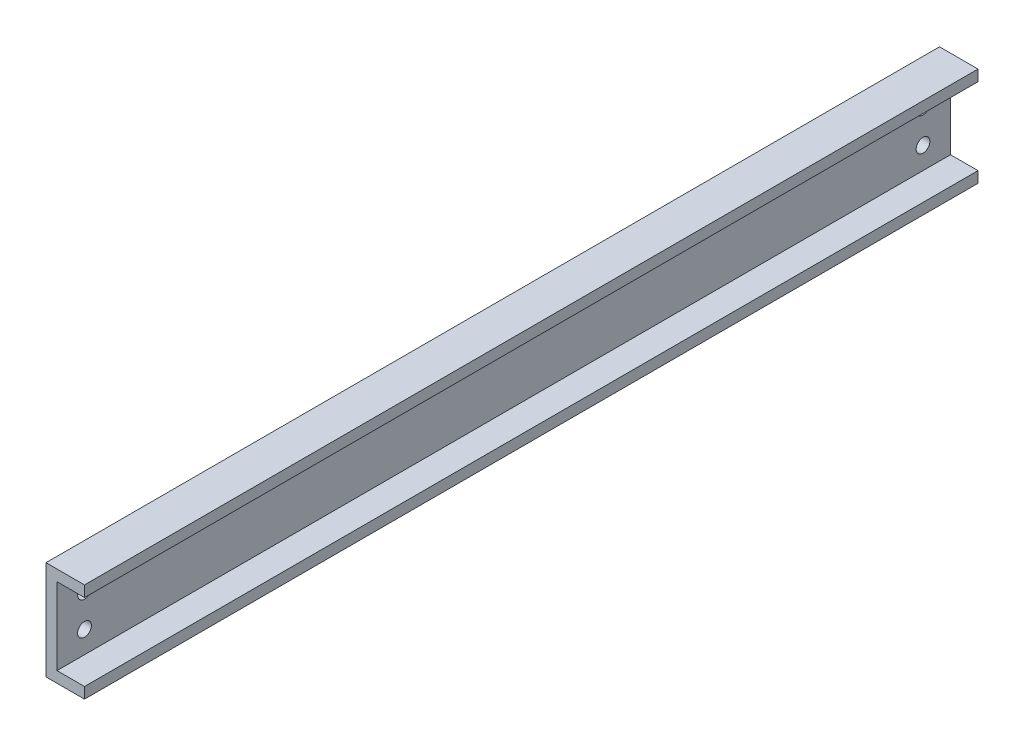
ISO-10303-21;
HEADER;
FILE_DESCRIPTION(('STEP AP214'),'2;1');
FILE_NAME('part.step','',(''),(''),'','','');
FILE_SCHEMA(('AUTOMOTIVE_DESIGN { 1 0 10303 214 1 1 1 1 }'));
ENDSEC;
DATA;
#1=APPLICATION_CONTEXT('core data for automotive mechanical design processes');
#2=APPLICATION_PROTOCOL_DEFINITION('international standard','automotive_design',2000,#1);
#3=PRODUCT_CONTEXT('',#1,'mechanical');
#4=PRODUCT('Part','Part','',(#3));
#5=PRODUCT_RELATED_PRODUCT_CATEGORY('part','',(#4));
#6=PRODUCT_DEFINITION_FORMATION('','',#4);
#7=PRODUCT_DEFINITION_CONTEXT('part definition',#1,'design');
#8=PRODUCT_DEFINITION('design','',#6,#7);
#9=PRODUCT_DEFINITION_SHAPE('','',#8);
#10=(LENGTH_UNIT() NAMED_UNIT(*) SI_UNIT(.MILLI.,.METRE.));
#11=(NAMED_UNIT(*) PLANE_ANGLE_UNIT() SI_UNIT($,.RADIAN.));
#12=(NAMED_UNIT(*) SI_UNIT($,.STERADIAN.) SOLID_ANGLE_UNIT());
#13=UNCERTAINTY_MEASURE_WITH_UNIT(LENGTH_MEASURE(1.E-05),#10,'distance_accuracy_value','');
#14=(GEOMETRIC_REPRESENTATION_CONTEXT(3) GLOBAL_UNCERTAINTY_ASSIGNED_CONTEXT((#13)) GLOBAL_UNIT_ASSIGNED_CONTEXT((#10,
#11,#12)) REPRESENTATION_CONTEXT('',''));
#15=CARTESIAN_POINT('',(0.,0.,0.));
#16=DIRECTION('',(0.,0.,1.));
#17=DIRECTION('',(1.,0.,0.));
#18=AXIS2_PLACEMENT_3D('',#15,#16,#17);
#19=CARTESIAN_POINT('',(0.,9.,-162.5));
#20=DIRECTION('',(0.,1.,0.));
#21=DIRECTION('',(0.,0.,1.));
#22=AXIS2_PLACEMENT_3D('',#19,#20,#21);
#23=PLANE('',#22);
#24=DIRECTION('',(-1.,0.,0.));
#25=VECTOR('',#24,1.);
#26=CARTESIAN_POINT('',(0.,9.,0.));
#27=LINE('',#26,#25);
#28=CARTESIAN_POINT('',(7.,9.,0.));
#29=VERTEX_POINT('',#28);
#30=CARTESIAN_POINT('',(0.,9.,0.));
#31=VERTEX_POINT('',#30);
#32=EDGE_CURVE('E130',#29,#31,#27,.T.);
#33=ORIENTED_EDGE('',*,*,#32,.F.);
#34=DIRECTION('',(0.,0.,1.));
#35=VECTOR('',#34,1.);
#36=CARTESIAN_POINT('',(7.,9.,-162.5));
#37=LINE('',#36,#35);
#38=CARTESIAN_POINT('',(7.,9.,-162.5));
#39=VERTEX_POINT('',#38);
#40=EDGE_CURVE('E11',#39,#29,#37,.T.);
#41=ORIENTED_EDGE('',*,*,#40,.F.);
#42=DIRECTION('',(-1.,0.,0.));
#43=VECTOR('',#42,1.);
#44=CARTESIAN_POINT('',(0.,9.,-162.5));
#45=LINE('',#44,#43);
#46=CARTESIAN_POINT('',(0.,9.,-162.5));
#47=VERTEX_POINT('',#46);
#48=EDGE_CURVE('E151',#39,#47,#45,.T.);
#49=ORIENTED_EDGE('',*,*,#48,.T.);
#50=DIRECTION('',(0.,0.,1.));
#51=VECTOR('',#50,1.);
#52=CARTESIAN_POINT('',(0.,9.,-162.5));
#53=LINE('',#52,#51);
#54=EDGE_CURVE('E36',#47,#31,#53,.T.);
#55=ORIENTED_EDGE('',*,*,#54,.T.);
#56=EDGE_LOOP('',(#33,#41,#49,#55));
#57=FACE_BOUND('',#56,.T.);
#58=ADVANCED_FACE('F33',(#57),#23,.T.);
#59=CARTESIAN_POINT('',(7.,9.,-162.5));
#60=DIRECTION('',(1.,0.,0.));
#61=DIRECTION('',(0.,0.,-1.));
#62=AXIS2_PLACEMENT_3D('',#59,#60,#61);
#63=PLANE('',#62);
#64=DIRECTION('',(0.,1.,0.));
#65=VECTOR('',#64,1.);
#66=CARTESIAN_POINT('',(7.,9.,0.));
#67=LINE('',#66,#65);
#68=CARTESIAN_POINT('',(7.,7.,0.));
#69=VERTEX_POINT('',#68);
#70=EDGE_CURVE('E149',#69,#29,#67,.T.);
#71=ORIENTED_EDGE('',*,*,#70,.F.);
#72=DIRECTION('',(0.,0.,1.));
#73=VECTOR('',#72,1.);
#74=CARTESIAN_POINT('',(7.,7.,-162.5));
#75=LINE('',#74,#73);
#76=CARTESIAN_POINT('',(7.,7.,-162.5));
#77=VERTEX_POINT('',#76);
#78=EDGE_CURVE('E42',#77,#69,#75,.T.);
#79=ORIENTED_EDGE('',*,*,#78,.F.);
#80=DIRECTION('',(0.,1.,0.));
#81=VECTOR('',#80,1.);
#82=CARTESIAN_POINT('',(7.,9.,-162.5));
#83=LINE('',#82,#81);
#84=EDGE_CURVE('E120',#77,#39,#83,.T.);
#85=ORIENTED_EDGE('',*,*,#84,.T.);
#86=ORIENTED_EDGE('',*,*,#40,.T.);
#87=EDGE_LOOP('',(#71,#79,#85,#86));
#88=FACE_BOUND('',#87,.T.);
#89=ADVANCED_FACE('F163',(#88),#63,.T.);
#90=CARTESIAN_POINT('',(2.,7.,-162.5));
#91=DIRECTION('',(0.,-1.,0.));
#92=DIRECTION('',(0.,0.,-1.));
#93=AXIS2_PLACEMENT_3D('',#90,#91,#92);
#94=PLANE('',#93);
#95=DIRECTION('',(1.,0.,0.));
#96=VECTOR('',#95,1.);
#97=CARTESIAN_POINT('',(2.,7.,0.));
#98=LINE('',#97,#96);
#99=CARTESIAN_POINT('',(2.,7.,0.));
#100=VERTEX_POINT('',#99);
#101=EDGE_CURVE('E107',#100,#69,#98,.T.);
#102=ORIENTED_EDGE('',*,*,#101,.F.);
#103=DIRECTION('',(0.,0.,1.));
#104=VECTOR('',#103,1.);
#105=CARTESIAN_POINT('',(2.,7.,-162.5));
#106=LINE('',#105,#104);
#107=CARTESIAN_POINT('',(2.,7.,-162.5));
#108=VERTEX_POINT('',#107);
#109=EDGE_CURVE('E102',#108,#100,#106,.T.);
#110=ORIENTED_EDGE('',*,*,#109,.F.);
#111=DIRECTION('',(1.,0.,0.));
#112=VECTOR('',#111,1.);
#113=CARTESIAN_POINT('',(2.,7.,-162.5));
#114=LINE('',#113,#112);
#115=EDGE_CURVE('E105',#108,#77,#114,.T.);
#116=ORIENTED_EDGE('',*,*,#115,.T.);
#117=ORIENTED_EDGE('',*,*,#78,.T.);
#118=EDGE_LOOP('',(#102,#110,#116,#117));
#119=FACE_BOUND('',#118,.T.);
#120=ADVANCED_FACE('F104',(#119),#94,.T.);
#121=CARTESIAN_POINT('',(2.,7.,-162.5));
#122=DIRECTION('',(1.,0.,0.));
#123=DIRECTION('',(0.,0.,-1.));
#124=AXIS2_PLACEMENT_3D('',#121,#122,#123);
#125=PLANE('',#124);
#126=CARTESIAN_POINT('',(2.,2.99999999999998,-157.5));
#127=DIRECTION('',(1.,0.,0.));
#128=DIRECTION('',(0.,0.,-1.));
#129=AXIS2_PLACEMENT_3D('',#126,#127,#128);
#130=CIRCLE('',#129,1.25000000000001);
#131=CARTESIAN_POINT('',(2.,2.99999999999998,-158.75));
#132=VERTEX_POINT('',#131);
#133=EDGE_CURVE('E134',#132,#132,#130,.T.);
#134=ORIENTED_EDGE('',*,*,#133,.F.);
#135=EDGE_LOOP('',(#134));
#136=FACE_BOUND('',#135,.T.);
#137=CARTESIAN_POINT('',(2.,-3.00000000000002,-157.5));
#138=DIRECTION('',(1.,0.,0.));
#139=DIRECTION('',(0.,0.,-1.));
#140=AXIS2_PLACEMENT_3D('',#137,#138,#139);
#141=CIRCLE('',#140,1.25000000000001);
#142=CARTESIAN_POINT('',(2.,-3.00000000000002,-158.75));
#143=VERTEX_POINT('',#142);
#144=EDGE_CURVE('E220',#143,#143,#141,.T.);
#145=ORIENTED_EDGE('',*,*,#144,.F.);
#146=EDGE_LOOP('',(#145));
#147=FACE_BOUND('',#146,.T.);
#148=CARTESIAN_POINT('',(2.,-3.,-5.));
#149=DIRECTION('',(1.,0.,0.));
#150=DIRECTION('',(0.,0.,-1.));
#151=AXIS2_PLACEMENT_3D('',#148,#149,#150);
#152=CIRCLE('',#151,1.25);
#153=CARTESIAN_POINT('',(2.,-3.,-6.25));
#154=VERTEX_POINT('',#153);
#155=EDGE_CURVE('E212',#154,#154,#152,.T.);
#156=ORIENTED_EDGE('',*,*,#155,.F.);
#157=EDGE_LOOP('',(#156));
#158=FACE_BOUND('',#157,.T.);
#159=CARTESIAN_POINT('',(2.,3.,-5.));
#160=DIRECTION('',(1.,0.,0.));
#161=DIRECTION('',(0.,0.,-1.));
#162=AXIS2_PLACEMENT_3D('',#159,#160,#161);
#163=CIRCLE('',#162,1.25);
#164=CARTESIAN_POINT('',(2.,3.,-6.25));
#165=VERTEX_POINT('',#164);
#166=EDGE_CURVE('E209',#165,#165,#163,.T.);
#167=ORIENTED_EDGE('',*,*,#166,.F.);
#168=EDGE_LOOP('',(#167));
#169=FACE_BOUND('',#168,.T.);
#170=DIRECTION('',(0.,1.,0.));
#171=VECTOR('',#170,1.);
#172=CARTESIAN_POINT('',(2.,7.,0.));
#173=LINE('',#172,#171);
#174=CARTESIAN_POINT('',(2.,-7.,0.));
#175=VERTEX_POINT('',#174);
#176=EDGE_CURVE('E146',#175,#100,#173,.T.);
#177=ORIENTED_EDGE('',*,*,#176,.F.);
#178=DIRECTION('',(0.,0.,1.));
#179=VECTOR('',#178,1.);
#180=CARTESIAN_POINT('',(2.,-7.,-162.5));
#181=LINE('',#180,#179);
#182=CARTESIAN_POINT('',(2.,-7.,-162.5));
#183=VERTEX_POINT('',#182);
#184=EDGE_CURVE('E112',#183,#175,#181,.T.);
#185=ORIENTED_EDGE('',*,*,#184,.F.);
#186=DIRECTION('',(0.,1.,0.));
#187=VECTOR('',#186,1.);
#188=CARTESIAN_POINT('',(2.,7.,-162.5));
#189=LINE('',#188,#187);
#190=EDGE_CURVE('E118',#183,#108,#189,.T.);
#191=ORIENTED_EDGE('',*,*,#190,.T.);
#192=ORIENTED_EDGE('',*,*,#109,.T.);
#193=EDGE_LOOP('',(#177,#185,#191,#192));
#194=FACE_BOUND('',#193,.T.);
#195=ADVANCED_FACE('F122',(#136,#147,#158,#169,#194),#125,.T.);
#196=CARTESIAN_POINT('',(2.,-7.,-162.5));
#197=DIRECTION('',(0.,1.,0.));
#198=DIRECTION('',(-1.,0.,0.));
#199=AXIS2_PLACEMENT_3D('',#196,#197,#198);
#200=PLANE('',#199);
#201=DIRECTION('',(-1.,0.,0.));
#202=VECTOR('',#201,1.);
#203=CARTESIAN_POINT('',(2.,-7.,0.));
#204=LINE('',#203,#202);
#205=CARTESIAN_POINT('',(7.,-7.,0.));
#206=VERTEX_POINT('',#205);
#207=EDGE_CURVE('E143',#206,#175,#204,.T.);
#208=ORIENTED_EDGE('',*,*,#207,.F.);
#209=DIRECTION('',(0.,0.,1.));
#210=VECTOR('',#209,1.);
#211=CARTESIAN_POINT('',(7.,-7.,-162.5));
#212=LINE('',#211,#210);
#213=CARTESIAN_POINT('',(7.,-7.,-162.5));
#214=VERTEX_POINT('',#213);
#215=EDGE_CURVE('E155',#214,#206,#212,.T.);
#216=ORIENTED_EDGE('',*,*,#215,.F.);
#217=DIRECTION('',(-1.,0.,0.));
#218=VECTOR('',#217,1.);
#219=CARTESIAN_POINT('',(2.,-7.,-162.5));
#220=LINE('',#219,#218);
#221=EDGE_CURVE('E123',#214,#183,#220,.T.);
#222=ORIENTED_EDGE('',*,*,#221,.T.);
#223=ORIENTED_EDGE('',*,*,#184,.T.);
#224=EDGE_LOOP('',(#208,#216,#222,#223));
#225=FACE_BOUND('',#224,.T.);
#226=ADVANCED_FACE('F176',(#225),#200,.T.);
#227=CARTESIAN_POINT('',(7.,-9.,-162.5));
#228=DIRECTION('',(1.,0.,0.));
#229=DIRECTION('',(0.,0.,-1.));
#230=AXIS2_PLACEMENT_3D('',#227,#228,#229);
#231=PLANE('',#230);
#232=DIRECTION('',(0.,1.,0.));
#233=VECTOR('',#232,1.);
#234=CARTESIAN_POINT('',(7.,-9.,0.));
#235=LINE('',#234,#233);
#236=CARTESIAN_POINT('',(7.,-9.,0.));
#237=VERTEX_POINT('',#236);
#238=EDGE_CURVE('E140',#237,#206,#235,.T.);
#239=ORIENTED_EDGE('',*,*,#238,.F.);
#240=DIRECTION('',(0.,0.,1.));
#241=VECTOR('',#240,1.);
#242=CARTESIAN_POINT('',(7.,-9.,-162.5));
#243=LINE('',#242,#241);
#244=CARTESIAN_POINT('',(7.,-9.,-162.5));
#245=VERTEX_POINT('',#244);
#246=EDGE_CURVE('E157',#245,#237,#243,.T.);
#247=ORIENTED_EDGE('',*,*,#246,.F.);
#248=DIRECTION('',(0.,1.,0.));
#249=VECTOR('',#248,1.);
#250=CARTESIAN_POINT('',(7.,-9.,-162.5));
#251=LINE('',#250,#249);
#252=EDGE_CURVE('E125',#245,#214,#251,.T.);
#253=ORIENTED_EDGE('',*,*,#252,.T.);
#254=ORIENTED_EDGE('',*,*,#215,.T.);
#255=EDGE_LOOP('',(#239,#247,#253,#254));
#256=FACE_BOUND('',#255,.T.);
#257=ADVANCED_FACE('F180',(#256),#231,.T.);
#258=CARTESIAN_POINT('',(0.,-9.,-162.5));
#259=DIRECTION('',(0.,-1.,0.));
#260=DIRECTION('',(0.,0.,-1.));
#261=AXIS2_PLACEMENT_3D('',#258,#259,#260);
#262=PLANE('',#261);
#263=DIRECTION('',(1.,0.,0.));
#264=VECTOR('',#263,1.);
#265=CARTESIAN_POINT('',(0.,-9.,0.));
#266=LINE('',#265,#264);
#267=CARTESIAN_POINT('',(0.,-9.,0.));
#268=VERTEX_POINT('',#267);
#269=EDGE_CURVE('E137',#268,#237,#266,.T.);
#270=ORIENTED_EDGE('',*,*,#269,.F.);
#271=DIRECTION('',(0.,0.,1.));
#272=VECTOR('',#271,1.);
#273=CARTESIAN_POINT('',(0.,-9.,-162.5));
#274=LINE('',#273,#272);
#275=CARTESIAN_POINT('',(0.,-9.,-162.5));
#276=VERTEX_POINT('',#275);
#277=EDGE_CURVE('E158',#276,#268,#274,.T.);
#278=ORIENTED_EDGE('',*,*,#277,.F.);
#279=DIRECTION('',(1.,0.,0.));
#280=VECTOR('',#279,1.);
#281=CARTESIAN_POINT('',(0.,-9.,-162.5));
#282=LINE('',#281,#280);
#283=EDGE_CURVE('E228',#276,#245,#282,.T.);
#284=ORIENTED_EDGE('',*,*,#283,.T.);
#285=ORIENTED_EDGE('',*,*,#246,.T.);
#286=EDGE_LOOP('',(#270,#278,#284,#285));
#287=FACE_BOUND('',#286,.T.);
#288=ADVANCED_FACE('F184',(#287),#262,.T.);
#289=CARTESIAN_POINT('',(0.,9.,-162.5));
#290=DIRECTION('',(-1.,0.,0.));
#291=DIRECTION('',(0.,-1.,0.));
#292=AXIS2_PLACEMENT_3D('',#289,#290,#291);
#293=PLANE('',#292);
#294=CARTESIAN_POINT('',(0.,2.99999999999998,-157.5));
#295=DIRECTION('',(-1.,0.,0.));
#296=DIRECTION('',(0.,1.,0.));
#297=AXIS2_PLACEMENT_3D('',#294,#295,#296);
#298=CIRCLE('',#297,1.25000000000001);
#299=CARTESIAN_POINT('',(0.,4.24999999999999,-157.5));
#300=VERTEX_POINT('',#299);
#301=EDGE_CURVE('E196',#300,#300,#298,.T.);
#302=ORIENTED_EDGE('',*,*,#301,.F.);
#303=EDGE_LOOP('',(#302));
#304=FACE_BOUND('',#303,.T.);
#305=CARTESIAN_POINT('',(0.,-3.00000000000002,-157.5));
#306=DIRECTION('',(-1.,0.,0.));
#307=DIRECTION('',(0.,-1.,0.));
#308=AXIS2_PLACEMENT_3D('',#305,#306,#307);
#309=CIRCLE('',#308,1.25000000000001);
#310=CARTESIAN_POINT('',(0.,-4.25000000000003,-157.5));
#311=VERTEX_POINT('',#310);
#312=EDGE_CURVE('E200',#311,#311,#309,.T.);
#313=ORIENTED_EDGE('',*,*,#312,.F.);
#314=EDGE_LOOP('',(#313));
#315=FACE_BOUND('',#314,.T.);
#316=CARTESIAN_POINT('',(0.,-3.,-5.));
#317=DIRECTION('',(-1.,0.,0.));
#318=DIRECTION('',(0.,1.,0.));
#319=AXIS2_PLACEMENT_3D('',#316,#317,#318);
#320=CIRCLE('',#319,1.25);
#321=CARTESIAN_POINT('',(0.,-1.75,-5.));
#322=VERTEX_POINT('',#321);
#323=EDGE_CURVE('E204',#322,#322,#320,.T.);
#324=ORIENTED_EDGE('',*,*,#323,.F.);
#325=EDGE_LOOP('',(#324));
#326=FACE_BOUND('',#325,.T.);
#327=CARTESIAN_POINT('',(0.,3.,-5.));
#328=DIRECTION('',(-1.,0.,0.));
#329=DIRECTION('',(0.,-1.,0.));
#330=AXIS2_PLACEMENT_3D('',#327,#328,#329);
#331=CIRCLE('',#330,1.25);
#332=CARTESIAN_POINT('',(0.,1.75,-5.));
#333=VERTEX_POINT('',#332);
#334=EDGE_CURVE('E207',#333,#333,#331,.T.);
#335=ORIENTED_EDGE('',*,*,#334,.F.);
#336=EDGE_LOOP('',(#335));
#337=FACE_BOUND('',#336,.T.);
#338=DIRECTION('',(0.,-1.,0.));
#339=VECTOR('',#338,1.);
#340=CARTESIAN_POINT('',(0.,9.,0.));
#341=LINE('',#340,#339);
#342=EDGE_CURVE('E133',#31,#268,#341,.T.);
#343=ORIENTED_EDGE('',*,*,#342,.F.);
#344=ORIENTED_EDGE('',*,*,#54,.F.);
#345=DIRECTION('',(0.,-1.,0.));
#346=VECTOR('',#345,1.);
#347=CARTESIAN_POINT('',(0.,9.,-162.5));
#348=LINE('',#347,#346);
#349=EDGE_CURVE('E226',#47,#276,#348,.T.);
#350=ORIENTED_EDGE('',*,*,#349,.T.);
#351=ORIENTED_EDGE('',*,*,#277,.T.);
#352=EDGE_LOOP('',(#343,#344,#350,#351));
#353=FACE_BOUND('',#352,.T.);
#354=ADVANCED_FACE('F160',(#304,#315,#326,#337,#353),#293,.T.);
#355=CARTESIAN_POINT('',(0.,0.,-162.5));
#356=DIRECTION('',(0.,0.,-1.));
#357=DIRECTION('',(-1.,0.,0.));
#358=AXIS2_PLACEMENT_3D('',#355,#356,#357);
#359=PLANE('',#358);
#360=ORIENTED_EDGE('',*,*,#48,.F.);
#361=ORIENTED_EDGE('',*,*,#84,.F.);
#362=ORIENTED_EDGE('',*,*,#115,.F.);
#363=ORIENTED_EDGE('',*,*,#190,.F.);
#364=ORIENTED_EDGE('',*,*,#221,.F.);
#365=ORIENTED_EDGE('',*,*,#252,.F.);
#366=ORIENTED_EDGE('',*,*,#283,.F.);
#367=ORIENTED_EDGE('',*,*,#349,.F.);
#368=EDGE_LOOP('',(#360,#361,#362,#363,#364,#365,#366,#367));
#369=FACE_BOUND('',#368,.T.);
#370=ADVANCED_FACE('F116',(#369),#359,.T.);
#371=CARTESIAN_POINT('',(0.,0.,0.));
#372=DIRECTION('',(0.,0.,-1.));
#373=DIRECTION('',(-1.,0.,0.));
#374=AXIS2_PLACEMENT_3D('',#371,#372,#373);
#375=PLANE('',#374);
#376=ORIENTED_EDGE('',*,*,#32,.T.);
#377=ORIENTED_EDGE('',*,*,#342,.T.);
#378=ORIENTED_EDGE('',*,*,#269,.T.);
#379=ORIENTED_EDGE('',*,*,#238,.T.);
#380=ORIENTED_EDGE('',*,*,#207,.T.);
#381=ORIENTED_EDGE('',*,*,#176,.T.);
#382=ORIENTED_EDGE('',*,*,#101,.T.);
#383=ORIENTED_EDGE('',*,*,#70,.T.);
#384=EDGE_LOOP('',(#376,#377,#378,#379,#380,#381,#382,#383));
#385=FACE_BOUND('',#384,.T.);
#386=ADVANCED_FACE('F162',(#385),#375,.F.);
#387=CARTESIAN_POINT('',(7.,3.,-5.));
#388=DIRECTION('',(-1.,0.,0.));
#389=DIRECTION('',(0.,-1.,0.));
#390=AXIS2_PLACEMENT_3D('',#387,#388,#389);
#391=CYLINDRICAL_SURFACE('',#390,1.25);
#392=ORIENTED_EDGE('',*,*,#166,.T.);
#393=EDGE_LOOP('',(#392));
#394=FACE_BOUND('',#393,.T.);
#395=ORIENTED_EDGE('',*,*,#334,.T.);
#396=EDGE_LOOP('',(#395));
#397=FACE_BOUND('',#396,.T.);
#398=ADVANCED_FACE('F246',(#394,#397),#391,.F.);
#399=CARTESIAN_POINT('',(7.,-3.,-5.));
#400=DIRECTION('',(-1.,0.,0.));
#401=DIRECTION('',(0.,-1.,0.));
#402=AXIS2_PLACEMENT_3D('',#399,#400,#401);
#403=CYLINDRICAL_SURFACE('',#402,1.25);
#404=ORIENTED_EDGE('',*,*,#155,.T.);
#405=EDGE_LOOP('',(#404));
#406=FACE_BOUND('',#405,.T.);
#407=ORIENTED_EDGE('',*,*,#323,.T.);
#408=EDGE_LOOP('',(#407));
#409=FACE_BOUND('',#408,.T.);
#410=ADVANCED_FACE('F248',(#406,#409),#403,.F.);
#411=CARTESIAN_POINT('',(7.,-3.00000000000002,-157.5));
#412=DIRECTION('',(-1.,0.,0.));
#413=DIRECTION('',(0.,-1.,0.));
#414=AXIS2_PLACEMENT_3D('',#411,#412,#413);
#415=CYLINDRICAL_SURFACE('',#414,1.25000000000001);
#416=ORIENTED_EDGE('',*,*,#144,.T.);
#417=EDGE_LOOP('',(#416));
#418=FACE_BOUND('',#417,.T.);
#419=ORIENTED_EDGE('',*,*,#312,.T.);
#420=EDGE_LOOP('',(#419));
#421=FACE_BOUND('',#420,.T.);
#422=ADVANCED_FACE('F254',(#418,#421),#415,.F.);
#423=CARTESIAN_POINT('',(7.,2.99999999999998,-157.5));
#424=DIRECTION('',(-1.,0.,0.));
#425=DIRECTION('',(0.,-1.,0.));
#426=AXIS2_PLACEMENT_3D('',#423,#424,#425);
#427=CYLINDRICAL_SURFACE('',#426,1.25000000000001);
#428=ORIENTED_EDGE('',*,*,#133,.T.);
#429=EDGE_LOOP('',(#428));
#430=FACE_BOUND('',#429,.T.);
#431=ORIENTED_EDGE('',*,*,#301,.T.);
#432=EDGE_LOOP('',(#431));
#433=FACE_BOUND('',#432,.T.);
#434=ADVANCED_FACE('F237',(#430,#433),#427,.F.);
#435=CLOSED_SHELL('',(#58,#89,#120,#195,#226,#257,#288,#354,#370,#386,#398,#410,#422,#434));
#436=MANIFOLD_SOLID_BREP('B2',#435);
#437=ADVANCED_BREP_SHAPE_REPRESENTATION('',(#18,#436),#14);
#438=SHAPE_DEFINITION_REPRESENTATION(#9,#437);
ENDSEC;
END-ISO-10303-21;
